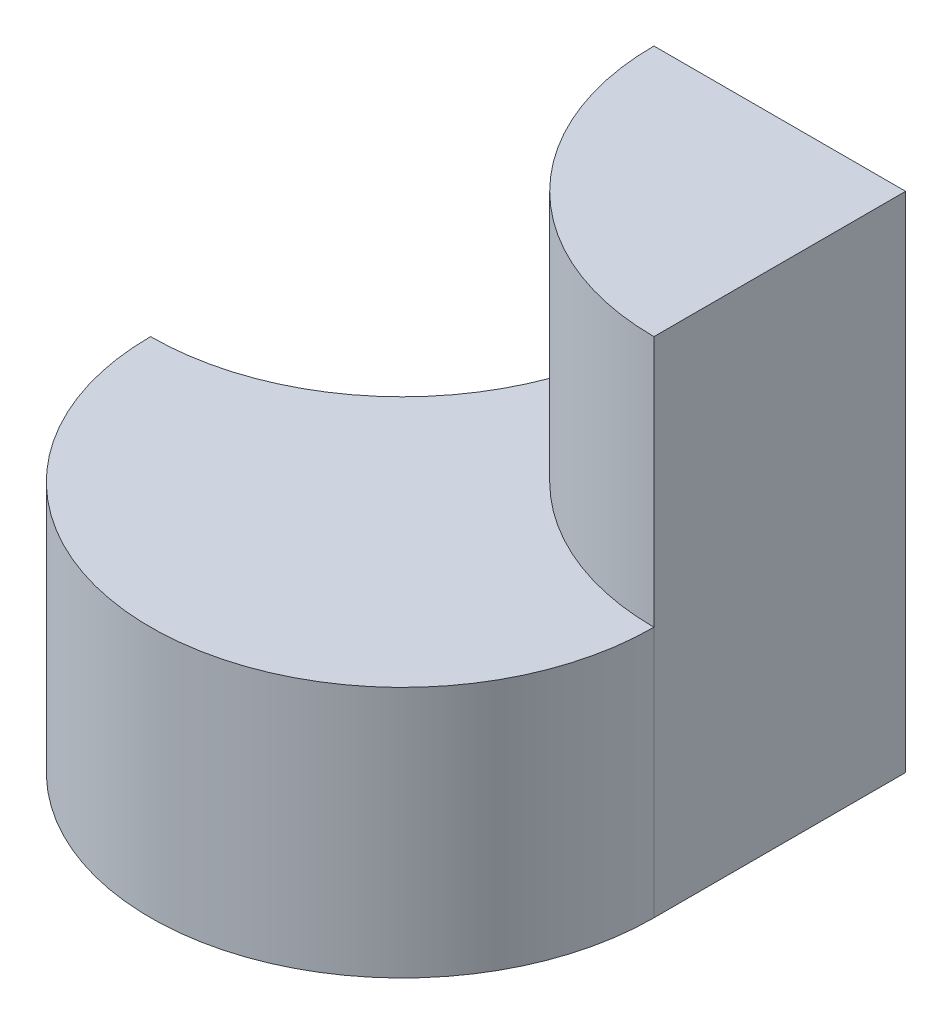
ISO-10303-21;
HEADER;
FILE_DESCRIPTION(('STEP AP214'),'2;1');
FILE_NAME('part.step','',(''),(''),'','','');
FILE_SCHEMA(('AUTOMOTIVE_DESIGN { 1 0 10303 214 1 1 1 1 }'));
ENDSEC;
DATA;
#1=APPLICATION_CONTEXT('core data for automotive mechanical design processes');
#2=APPLICATION_PROTOCOL_DEFINITION('international standard','automotive_design',2000,#1);
#3=PRODUCT_CONTEXT('',#1,'mechanical');
#4=PRODUCT('Part','Part','',(#3));
#5=PRODUCT_RELATED_PRODUCT_CATEGORY('part','',(#4));
#6=PRODUCT_DEFINITION_FORMATION('','',#4);
#7=PRODUCT_DEFINITION_CONTEXT('part definition',#1,'design');
#8=PRODUCT_DEFINITION('design','',#6,#7);
#9=PRODUCT_DEFINITION_SHAPE('','',#8);
#10=(LENGTH_UNIT() NAMED_UNIT(*) SI_UNIT(.MILLI.,.METRE.));
#11=(NAMED_UNIT(*) PLANE_ANGLE_UNIT() SI_UNIT($,.RADIAN.));
#12=(NAMED_UNIT(*) SI_UNIT($,.STERADIAN.) SOLID_ANGLE_UNIT());
#13=UNCERTAINTY_MEASURE_WITH_UNIT(LENGTH_MEASURE(1.E-05),#10,'distance_accuracy_value','');
#14=(GEOMETRIC_REPRESENTATION_CONTEXT(3) GLOBAL_UNCERTAINTY_ASSIGNED_CONTEXT((#13)) GLOBAL_UNIT_ASSIGNED_CONTEXT((#10,
#11,#12)) REPRESENTATION_CONTEXT('',''));
#15=CARTESIAN_POINT('',(0.,0.,0.));
#16=DIRECTION('',(0.,0.,1.));
#17=DIRECTION('',(1.,0.,0.));
#18=AXIS2_PLACEMENT_3D('',#15,#16,#17);
#19=CARTESIAN_POINT('',(20.,40.,20.));
#20=DIRECTION('',(0.,-1.,0.));
#21=DIRECTION('',(0.,0.,-1.));
#22=AXIS2_PLACEMENT_3D('',#19,#20,#21);
#23=CYLINDRICAL_SURFACE('',#22,20.);
#24=CARTESIAN_POINT('',(20.,20.,20.));
#25=DIRECTION('',(0.,-1.,0.));
#26=DIRECTION('',(0.,0.,-1.));
#27=AXIS2_PLACEMENT_3D('',#24,#25,#26);
#28=CIRCLE('',#27,20.);
#29=CARTESIAN_POINT('',(0.,20.,20.));
#30=VERTEX_POINT('',#29);
#31=CARTESIAN_POINT('',(40.,20.,20.));
#32=VERTEX_POINT('',#31);
#33=EDGE_CURVE('E124',#30,#32,#28,.F.);
#34=ORIENTED_EDGE('',*,*,#33,.F.);
#35=DIRECTION('',(0.,-1.,0.));
#36=VECTOR('',#35,1.);
#37=CARTESIAN_POINT('',(0.,40.,20.));
#38=LINE('',#37,#36);
#39=CARTESIAN_POINT('',(0.,0.,20.));
#40=VERTEX_POINT('',#39);
#41=EDGE_CURVE('E108',#30,#40,#38,.T.);
#42=ORIENTED_EDGE('',*,*,#41,.T.);
#43=CARTESIAN_POINT('',(20.,0.,20.));
#44=DIRECTION('',(0.,-1.,0.));
#45=DIRECTION('',(0.,0.,-1.));
#46=AXIS2_PLACEMENT_3D('',#43,#44,#45);
#47=CIRCLE('',#46,20.);
#48=CARTESIAN_POINT('',(40.,0.,20.));
#49=VERTEX_POINT('',#48);
#50=EDGE_CURVE('E115',#40,#49,#47,.F.);
#51=ORIENTED_EDGE('',*,*,#50,.T.);
#52=DIRECTION('',(0.,-1.,0.));
#53=VECTOR('',#52,1.);
#54=CARTESIAN_POINT('',(40.,40.,20.));
#55=LINE('',#54,#53);
#56=EDGE_CURVE('E126',#32,#49,#55,.T.);
#57=ORIENTED_EDGE('',*,*,#56,.F.);
#58=EDGE_LOOP('',(#34,#42,#51,#57));
#59=FACE_BOUND('',#58,.T.);
#60=ADVANCED_FACE('F51',(#59),#23,.T.);
#61=CARTESIAN_POINT('',(20.,20.,40.));
#62=DIRECTION('',(0.,-1.,0.));
#63=DIRECTION('',(0.,0.,-1.));
#64=AXIS2_PLACEMENT_3D('',#61,#62,#63);
#65=PLANE('',#64);
#66=CARTESIAN_POINT('',(40.,20.,0.));
#67=DIRECTION('',(0.,1.,0.));
#68=DIRECTION('',(0.,0.,1.));
#69=AXIS2_PLACEMENT_3D('',#66,#67,#68);
#70=CIRCLE('',#69,20.);
#71=CARTESIAN_POINT('',(20.,20.,0.));
#72=VERTEX_POINT('',#71);
#73=EDGE_CURVE('E109',#72,#32,#70,.T.);
#74=ORIENTED_EDGE('',*,*,#73,.F.);
#75=CARTESIAN_POINT('',(0.,20.,0.));
#76=DIRECTION('',(0.,-1.,0.));
#77=DIRECTION('',(0.,0.,-1.));
#78=AXIS2_PLACEMENT_3D('',#75,#76,#77);
#79=CIRCLE('',#78,20.);
#80=EDGE_CURVE('E66',#72,#30,#79,.T.);
#81=ORIENTED_EDGE('',*,*,#80,.T.);
#82=ORIENTED_EDGE('',*,*,#33,.T.);
#83=EDGE_LOOP('',(#74,#81,#82));
#84=FACE_BOUND('',#83,.T.);
#85=ADVANCED_FACE('F145',(#84),#65,.F.);
#86=CARTESIAN_POINT('',(0.,0.,40.));
#87=DIRECTION('',(1.,0.,0.));
#88=DIRECTION('',(0.,0.,-1.));
#89=AXIS2_PLACEMENT_3D('',#86,#87,#88);
#90=PLANE('',#89);
#91=ORIENTED_EDGE('',*,*,#41,.F.);
#92=DIRECTION('',(0.,-0.707106781186547,-0.707106781186548));
#93=VECTOR('',#92,1.);
#94=CARTESIAN_POINT('',(0.,0.,0.));
#95=LINE('',#94,#93);
#96=CARTESIAN_POINT('',(0.,0.,0.));
#97=VERTEX_POINT('',#96);
#98=EDGE_CURVE('E97',#30,#97,#95,.T.);
#99=ORIENTED_EDGE('',*,*,#98,.T.);
#100=DIRECTION('',(0.,0.,-1.));
#101=VECTOR('',#100,1.);
#102=CARTESIAN_POINT('',(0.,0.,40.));
#103=LINE('',#102,#101);
#104=EDGE_CURVE('E59',#40,#97,#103,.T.);
#105=ORIENTED_EDGE('',*,*,#104,.F.);
#106=EDGE_LOOP('',(#91,#99,#105));
#107=FACE_BOUND('',#106,.T.);
#108=ADVANCED_FACE('F107',(#107),#90,.F.);
#109=CARTESIAN_POINT('',(0.,0.,0.));
#110=DIRECTION('',(0.,0.,-1.));
#111=DIRECTION('',(-1.,0.,0.));
#112=AXIS2_PLACEMENT_3D('',#109,#110,#111);
#113=PLANE('',#112);
#114=DIRECTION('',(-0.707106781186548,-0.707106781186547,0.));
#115=VECTOR('',#114,1.);
#116=CARTESIAN_POINT('',(0.,0.,0.));
#117=LINE('',#116,#115);
#118=EDGE_CURVE('E94',#72,#97,#117,.T.);
#119=ORIENTED_EDGE('',*,*,#118,.F.);
#120=DIRECTION('',(0.,-1.,0.));
#121=VECTOR('',#120,1.);
#122=CARTESIAN_POINT('',(20.,40.,0.));
#123=LINE('',#122,#121);
#124=CARTESIAN_POINT('',(20.,40.,0.));
#125=VERTEX_POINT('',#124);
#126=EDGE_CURVE('E128',#125,#72,#123,.T.);
#127=ORIENTED_EDGE('',*,*,#126,.F.);
#128=DIRECTION('',(-1.,0.,0.));
#129=VECTOR('',#128,1.);
#130=CARTESIAN_POINT('',(20.,40.,0.));
#131=LINE('',#130,#129);
#132=CARTESIAN_POINT('',(40.,40.,0.));
#133=VERTEX_POINT('',#132);
#134=EDGE_CURVE('E139',#133,#125,#131,.T.);
#135=ORIENTED_EDGE('',*,*,#134,.F.);
#136=DIRECTION('',(0.,1.,0.));
#137=VECTOR('',#136,1.);
#138=CARTESIAN_POINT('',(40.,20.,0.));
#139=LINE('',#138,#137);
#140=CARTESIAN_POINT('',(40.,0.,0.));
#141=VERTEX_POINT('',#140);
#142=EDGE_CURVE('E116',#141,#133,#139,.T.);
#143=ORIENTED_EDGE('',*,*,#142,.F.);
#144=DIRECTION('',(1.,0.,0.));
#145=VECTOR('',#144,1.);
#146=CARTESIAN_POINT('',(40.,0.,0.));
#147=LINE('',#146,#145);
#148=EDGE_CURVE('E114',#97,#141,#147,.T.);
#149=ORIENTED_EDGE('',*,*,#148,.F.);
#150=EDGE_LOOP('',(#119,#127,#135,#143,#149));
#151=FACE_BOUND('',#150,.T.);
#152=ADVANCED_FACE('F117',(#151),#113,.T.);
#153=CARTESIAN_POINT('',(40.,20.,40.));
#154=DIRECTION('',(-1.,0.,0.));
#155=DIRECTION('',(0.,-1.,0.));
#156=AXIS2_PLACEMENT_3D('',#153,#154,#155);
#157=PLANE('',#156);
#158=ORIENTED_EDGE('',*,*,#56,.T.);
#159=DIRECTION('',(0.,0.,-1.));
#160=VECTOR('',#159,1.);
#161=CARTESIAN_POINT('',(40.,0.,40.));
#162=LINE('',#161,#160);
#163=EDGE_CURVE('E12',#49,#141,#162,.T.);
#164=ORIENTED_EDGE('',*,*,#163,.T.);
#165=ORIENTED_EDGE('',*,*,#142,.T.);
#166=DIRECTION('',(0.,0.,-1.));
#167=VECTOR('',#166,1.);
#168=CARTESIAN_POINT('',(40.,40.,0.));
#169=LINE('',#168,#167);
#170=CARTESIAN_POINT('',(40.,40.,20.));
#171=VERTEX_POINT('',#170);
#172=EDGE_CURVE('E137',#171,#133,#169,.T.);
#173=ORIENTED_EDGE('',*,*,#172,.F.);
#174=DIRECTION('',(0.,-1.,0.));
#175=VECTOR('',#174,1.);
#176=CARTESIAN_POINT('',(40.,40.,20.));
#177=LINE('',#176,#175);
#178=EDGE_CURVE('E131',#171,#32,#177,.T.);
#179=ORIENTED_EDGE('',*,*,#178,.T.);
#180=EDGE_LOOP('',(#158,#164,#165,#173,#179));
#181=FACE_BOUND('',#180,.T.);
#182=ADVANCED_FACE('F153',(#181),#157,.F.);
#183=CARTESIAN_POINT('',(40.,0.,40.));
#184=DIRECTION('',(0.,1.,0.));
#185=DIRECTION('',(0.,0.,1.));
#186=AXIS2_PLACEMENT_3D('',#183,#184,#185);
#187=PLANE('',#186);
#188=ORIENTED_EDGE('',*,*,#163,.F.);
#189=ORIENTED_EDGE('',*,*,#50,.F.);
#190=ORIENTED_EDGE('',*,*,#104,.T.);
#191=ORIENTED_EDGE('',*,*,#148,.T.);
#192=EDGE_LOOP('',(#188,#189,#190,#191));
#193=FACE_BOUND('',#192,.T.);
#194=ADVANCED_FACE('F53',(#193),#187,.F.);
#195=CARTESIAN_POINT('',(40.,40.,0.));
#196=DIRECTION('',(0.,-1.,0.));
#197=DIRECTION('',(0.,0.,-1.));
#198=AXIS2_PLACEMENT_3D('',#195,#196,#197);
#199=CYLINDRICAL_SURFACE('',#198,20.);
#200=ORIENTED_EDGE('',*,*,#73,.T.);
#201=ORIENTED_EDGE('',*,*,#178,.F.);
#202=CARTESIAN_POINT('',(40.,40.,0.));
#203=DIRECTION('',(0.,1.,0.));
#204=DIRECTION('',(0.,0.,1.));
#205=AXIS2_PLACEMENT_3D('',#202,#203,#204);
#206=CIRCLE('',#205,20.);
#207=EDGE_CURVE('E134',#125,#171,#206,.T.);
#208=ORIENTED_EDGE('',*,*,#207,.F.);
#209=ORIENTED_EDGE('',*,*,#126,.T.);
#210=EDGE_LOOP('',(#200,#201,#208,#209));
#211=FACE_BOUND('',#210,.T.);
#212=ADVANCED_FACE('F150',(#211),#199,.T.);
#213=CARTESIAN_POINT('',(40.,40.,0.));
#214=DIRECTION('',(0.,1.,0.));
#215=DIRECTION('',(0.,0.,1.));
#216=AXIS2_PLACEMENT_3D('',#213,#214,#215);
#217=PLANE('',#216);
#218=ORIENTED_EDGE('',*,*,#172,.T.);
#219=ORIENTED_EDGE('',*,*,#134,.T.);
#220=ORIENTED_EDGE('',*,*,#207,.T.);
#221=EDGE_LOOP('',(#218,#219,#220));
#222=FACE_BOUND('',#221,.T.);
#223=ADVANCED_FACE('F155',(#222),#217,.T.);
#224=CARTESIAN_POINT('',(0.,0.,0.));
#225=DIRECTION('',(0.,1.,0.));
#226=DIRECTION('',(0.,0.,1.));
#227=AXIS2_PLACEMENT_3D('',#224,#225,#226);
#228=CONICAL_SURFACE('',#227,0.,0.785398163397448);
#229=ORIENTED_EDGE('',*,*,#80,.F.);
#230=ORIENTED_EDGE('',*,*,#118,.T.);
#231=ORIENTED_EDGE('',*,*,#98,.F.);
#232=EDGE_LOOP('',(#229,#230,#231));
#233=FACE_BOUND('',#232,.T.);
#234=ADVANCED_FACE('F96',(#233),#228,.F.);
#235=CLOSED_SHELL('',(#60,#85,#108,#152,#182,#194,#212,#223,#234));
#236=MANIFOLD_SOLID_BREP('B2',#235);
#237=ADVANCED_BREP_SHAPE_REPRESENTATION('',(#18,#236),#14);
#238=SHAPE_DEFINITION_REPRESENTATION(#9,#237);
ENDSEC;
END-ISO-10303-21;
